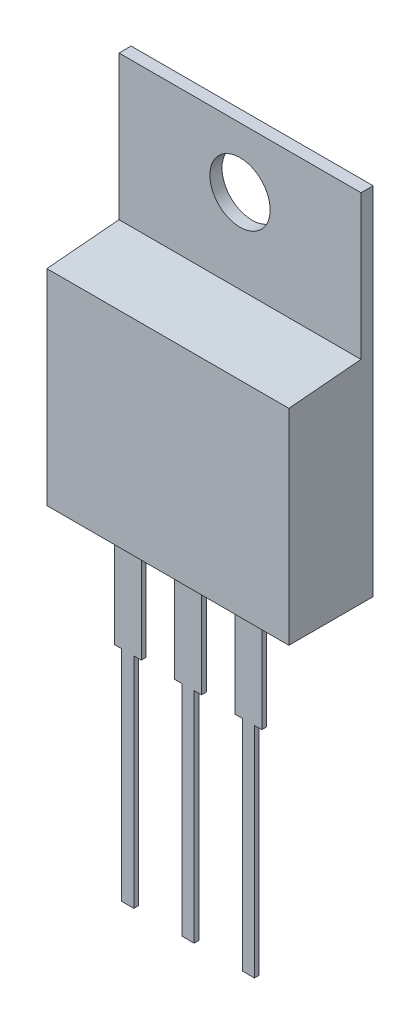
ISO-10303-21;
HEADER;
FILE_DESCRIPTION(('STEP AP214'),'2;1');
FILE_NAME('part.step','',(''),(''),'','','');
FILE_SCHEMA(('AUTOMOTIVE_DESIGN { 1 0 10303 214 1 1 1 1 }'));
ENDSEC;
DATA;
#1=APPLICATION_CONTEXT('core data for automotive mechanical design processes');
#2=APPLICATION_PROTOCOL_DEFINITION('international standard','automotive_design',2000,#1);
#3=PRODUCT_CONTEXT('',#1,'mechanical');
#4=PRODUCT('Part','Part','',(#3));
#5=PRODUCT_RELATED_PRODUCT_CATEGORY('part','',(#4));
#6=PRODUCT_DEFINITION_FORMATION('','',#4);
#7=PRODUCT_DEFINITION_CONTEXT('part definition',#1,'design');
#8=PRODUCT_DEFINITION('design','',#6,#7);
#9=PRODUCT_DEFINITION_SHAPE('','',#8);
#10=(LENGTH_UNIT() NAMED_UNIT(*) SI_UNIT(.MILLI.,.METRE.));
#11=(NAMED_UNIT(*) PLANE_ANGLE_UNIT() SI_UNIT($,.RADIAN.));
#12=(NAMED_UNIT(*) SI_UNIT($,.STERADIAN.) SOLID_ANGLE_UNIT());
#13=UNCERTAINTY_MEASURE_WITH_UNIT(LENGTH_MEASURE(1.E-05),#10,'distance_accuracy_value','');
#14=(GEOMETRIC_REPRESENTATION_CONTEXT(3) GLOBAL_UNCERTAINTY_ASSIGNED_CONTEXT((#13)) GLOBAL_UNIT_ASSIGNED_CONTEXT((#10,
#11,#12)) REPRESENTATION_CONTEXT('',''));
#15=CARTESIAN_POINT('',(0.,0.,0.));
#16=DIRECTION('',(0.,0.,1.));
#17=DIRECTION('',(1.,0.,0.));
#18=AXIS2_PLACEMENT_3D('',#15,#16,#17);
#19=CARTESIAN_POINT('',(7.07,-4.5,2.7));
#20=DIRECTION('',(0.,-1.,0.));
#21=DIRECTION('',(0.,0.,-1.));
#22=AXIS2_PLACEMENT_3D('',#19,#20,#21);
#23=PLANE('',#22);
#24=DIRECTION('',(1.,0.,0.));
#25=VECTOR('',#24,1.);
#26=CARTESIAN_POINT('',(7.07,-4.5,2.5));
#27=LINE('',#26,#25);
#28=CARTESIAN_POINT('',(7.07,-4.5,2.5));
#29=VERTEX_POINT('',#28);
#30=CARTESIAN_POINT('',(7.385,-4.5,2.5));
#31=VERTEX_POINT('',#30);
#32=EDGE_CURVE('E367',#29,#31,#27,.T.);
#33=ORIENTED_EDGE('',*,*,#32,.T.);
#34=DIRECTION('',(0.,0.,1.));
#35=VECTOR('',#34,1.);
#36=CARTESIAN_POINT('',(7.385,-4.5,2.5));
#37=LINE('',#36,#35);
#38=CARTESIAN_POINT('',(7.385,-4.5,2.7));
#39=VERTEX_POINT('',#38);
#40=EDGE_CURVE('E244',#31,#39,#37,.T.);
#41=ORIENTED_EDGE('',*,*,#40,.T.);
#42=DIRECTION('',(1.,0.,0.));
#43=VECTOR('',#42,1.);
#44=CARTESIAN_POINT('',(7.07,-4.5,2.7));
#45=LINE('',#44,#43);
#46=CARTESIAN_POINT('',(7.07,-4.5,2.7));
#47=VERTEX_POINT('',#46);
#48=EDGE_CURVE('E363',#47,#39,#45,.T.);
#49=ORIENTED_EDGE('',*,*,#48,.F.);
#50=DIRECTION('',(0.,0.,-1.));
#51=VECTOR('',#50,1.);
#52=CARTESIAN_POINT('',(7.07,-4.5,2.7));
#53=LINE('',#52,#51);
#54=EDGE_CURVE('E331',#47,#29,#53,.T.);
#55=ORIENTED_EDGE('',*,*,#54,.T.);
#56=EDGE_LOOP('',(#33,#41,#49,#55));
#57=FACE_BOUND('',#56,.T.);
#58=ADVANCED_FACE('F39',(#57),#23,.T.);
#59=CARTESIAN_POINT('',(4.53,-4.5,2.7));
#60=DIRECTION('',(0.,-1.,0.));
#61=DIRECTION('',(0.,0.,-1.));
#62=AXIS2_PLACEMENT_3D('',#59,#60,#61);
#63=PLANE('',#62);
#64=DIRECTION('',(1.,0.,0.));
#65=VECTOR('',#64,1.);
#66=CARTESIAN_POINT('',(4.53,-4.5,2.5));
#67=LINE('',#66,#65);
#68=CARTESIAN_POINT('',(4.53,-4.5,2.5));
#69=VERTEX_POINT('',#68);
#70=CARTESIAN_POINT('',(4.845,-4.5,2.5));
#71=VERTEX_POINT('',#70);
#72=EDGE_CURVE('E911',#69,#71,#67,.T.);
#73=ORIENTED_EDGE('',*,*,#72,.T.);
#74=DIRECTION('',(0.,0.,1.));
#75=VECTOR('',#74,1.);
#76=CARTESIAN_POINT('',(4.845,-4.5,2.5));
#77=LINE('',#76,#75);
#78=CARTESIAN_POINT('',(4.845,-4.5,2.7));
#79=VERTEX_POINT('',#78);
#80=EDGE_CURVE('E301',#71,#79,#77,.T.);
#81=ORIENTED_EDGE('',*,*,#80,.T.);
#82=DIRECTION('',(1.,0.,0.));
#83=VECTOR('',#82,1.);
#84=CARTESIAN_POINT('',(4.53,-4.5,2.7));
#85=LINE('',#84,#83);
#86=CARTESIAN_POINT('',(4.53,-4.5,2.7));
#87=VERTEX_POINT('',#86);
#88=EDGE_CURVE('E419',#87,#79,#85,.T.);
#89=ORIENTED_EDGE('',*,*,#88,.F.);
#90=DIRECTION('',(0.,0.,-1.));
#91=VECTOR('',#90,1.);
#92=CARTESIAN_POINT('',(4.53,-4.5,2.7));
#93=LINE('',#92,#91);
#94=EDGE_CURVE('E928',#87,#69,#93,.T.);
#95=ORIENTED_EDGE('',*,*,#94,.T.);
#96=EDGE_LOOP('',(#73,#81,#89,#95));
#97=FACE_BOUND('',#96,.T.);
#98=ADVANCED_FACE('F568',(#97),#63,.T.);
#99=CARTESIAN_POINT('',(0.,0.,0.51));
#100=DIRECTION('',(0.,1.,0.));
#101=DIRECTION('',(0.,0.,1.));
#102=AXIS2_PLACEMENT_3D('',#99,#100,#101);
#103=PLANE('',#102);
#104=DIRECTION('',(0.,0.,1.));
#105=VECTOR('',#104,1.);
#106=CARTESIAN_POINT('',(4.53,0.,2.5));
#107=LINE('',#106,#105);
#108=CARTESIAN_POINT('',(4.53,0.,2.5));
#109=VERTEX_POINT('',#108);
#110=CARTESIAN_POINT('',(4.53,0.,2.7));
#111=VERTEX_POINT('',#110);
#112=EDGE_CURVE('E398',#109,#111,#107,.T.);
#113=ORIENTED_EDGE('',*,*,#112,.T.);
#114=DIRECTION('',(1.,0.,0.));
#115=VECTOR('',#114,1.);
#116=CARTESIAN_POINT('',(4.53,0.,2.7));
#117=LINE('',#116,#115);
#118=CARTESIAN_POINT('',(5.67,0.,2.7));
#119=VERTEX_POINT('',#118);
#120=EDGE_CURVE('E409',#111,#119,#117,.T.);
#121=ORIENTED_EDGE('',*,*,#120,.T.);
#122=DIRECTION('',(0.,0.,1.));
#123=VECTOR('',#122,1.);
#124=CARTESIAN_POINT('',(5.67,0.,2.5));
#125=LINE('',#124,#123);
#126=CARTESIAN_POINT('',(5.67,0.,2.5));
#127=VERTEX_POINT('',#126);
#128=EDGE_CURVE('E403',#127,#119,#125,.T.);
#129=ORIENTED_EDGE('',*,*,#128,.F.);
#130=DIRECTION('',(1.,0.,0.));
#131=VECTOR('',#130,1.);
#132=CARTESIAN_POINT('',(4.53,0.,2.5));
#133=LINE('',#132,#131);
#134=EDGE_CURVE('E407',#109,#127,#133,.T.);
#135=ORIENTED_EDGE('',*,*,#134,.F.);
#136=EDGE_LOOP('',(#113,#121,#129,#135));
#137=FACE_BOUND('',#136,.T.);
#138=DIRECTION('',(1.,0.,0.));
#139=VECTOR('',#138,1.);
#140=CARTESIAN_POINT('',(0.,0.,0.));
#141=LINE('',#140,#139);
#142=CARTESIAN_POINT('',(0.,0.,0.));
#143=VERTEX_POINT('',#142);
#144=CARTESIAN_POINT('',(10.2,0.,0.));
#145=VERTEX_POINT('',#144);
#146=EDGE_CURVE('E514',#143,#145,#141,.T.);
#147=ORIENTED_EDGE('',*,*,#146,.T.);
#148=DIRECTION('',(0.,0.,-1.));
#149=VECTOR('',#148,1.);
#150=CARTESIAN_POINT('',(10.2,0.,0.51));
#151=LINE('',#150,#149);
#152=CARTESIAN_POINT('',(10.2,0.,3.55));
#153=VERTEX_POINT('',#152);
#154=EDGE_CURVE('E48',#153,#145,#151,.T.);
#155=ORIENTED_EDGE('',*,*,#154,.F.);
#156=DIRECTION('',(1.,0.,0.));
#157=VECTOR('',#156,1.);
#158=CARTESIAN_POINT('',(0.,0.,3.55));
#159=LINE('',#158,#157);
#160=CARTESIAN_POINT('',(0.,0.,3.55));
#161=VERTEX_POINT('',#160);
#162=EDGE_CURVE('E526',#161,#153,#159,.T.);
#163=ORIENTED_EDGE('',*,*,#162,.F.);
#164=DIRECTION('',(0.,0.,-1.));
#165=VECTOR('',#164,1.);
#166=CARTESIAN_POINT('',(0.,0.,0.51));
#167=LINE('',#166,#165);
#168=EDGE_CURVE('E11',#161,#143,#167,.T.);
#169=ORIENTED_EDGE('',*,*,#168,.T.);
#170=EDGE_LOOP('',(#147,#155,#163,#169));
#171=FACE_BOUND('',#170,.T.);
#172=DIRECTION('',(0.,0.,1.));
#173=VECTOR('',#172,1.);
#174=CARTESIAN_POINT('',(1.99,0.,2.5));
#175=LINE('',#174,#173);
#176=CARTESIAN_POINT('',(1.99,0.,2.5));
#177=VERTEX_POINT('',#176);
#178=CARTESIAN_POINT('',(1.99,0.,2.7));
#179=VERTEX_POINT('',#178);
#180=EDGE_CURVE('E454',#177,#179,#175,.T.);
#181=ORIENTED_EDGE('',*,*,#180,.T.);
#182=DIRECTION('',(1.,0.,0.));
#183=VECTOR('',#182,1.);
#184=CARTESIAN_POINT('',(1.99,0.,2.7));
#185=LINE('',#184,#183);
#186=CARTESIAN_POINT('',(3.13,0.,2.7));
#187=VERTEX_POINT('',#186);
#188=EDGE_CURVE('E470',#179,#187,#185,.T.);
#189=ORIENTED_EDGE('',*,*,#188,.T.);
#190=DIRECTION('',(0.,0.,1.));
#191=VECTOR('',#190,1.);
#192=CARTESIAN_POINT('',(3.13,0.,2.5));
#193=LINE('',#192,#191);
#194=CARTESIAN_POINT('',(3.13,0.,2.5));
#195=VERTEX_POINT('',#194);
#196=EDGE_CURVE('E448',#195,#187,#193,.T.);
#197=ORIENTED_EDGE('',*,*,#196,.F.);
#198=DIRECTION('',(1.,0.,0.));
#199=VECTOR('',#198,1.);
#200=CARTESIAN_POINT('',(1.99,0.,2.5));
#201=LINE('',#200,#199);
#202=EDGE_CURVE('E457',#177,#195,#201,.T.);
#203=ORIENTED_EDGE('',*,*,#202,.F.);
#204=EDGE_LOOP('',(#181,#189,#197,#203));
#205=FACE_BOUND('',#204,.T.);
#206=DIRECTION('',(0.,0.,1.));
#207=VECTOR('',#206,1.);
#208=CARTESIAN_POINT('',(7.07,0.,2.5));
#209=LINE('',#208,#207);
#210=CARTESIAN_POINT('',(7.07,0.,2.5));
#211=VERTEX_POINT('',#210);
#212=CARTESIAN_POINT('',(7.07,0.,2.7));
#213=VERTEX_POINT('',#212);
#214=EDGE_CURVE('E338',#211,#213,#209,.T.);
#215=ORIENTED_EDGE('',*,*,#214,.T.);
#216=DIRECTION('',(1.,0.,0.));
#217=VECTOR('',#216,1.);
#218=CARTESIAN_POINT('',(7.07,0.,2.7));
#219=LINE('',#218,#217);
#220=CARTESIAN_POINT('',(8.21,0.,2.7));
#221=VERTEX_POINT('',#220);
#222=EDGE_CURVE('E353',#213,#221,#219,.T.);
#223=ORIENTED_EDGE('',*,*,#222,.T.);
#224=DIRECTION('',(0.,0.,1.));
#225=VECTOR('',#224,1.);
#226=CARTESIAN_POINT('',(8.21,0.,2.5));
#227=LINE('',#226,#225);
#228=CARTESIAN_POINT('',(8.21,0.,2.5));
#229=VERTEX_POINT('',#228);
#230=EDGE_CURVE('E332',#229,#221,#227,.T.);
#231=ORIENTED_EDGE('',*,*,#230,.F.);
#232=DIRECTION('',(1.,0.,0.));
#233=VECTOR('',#232,1.);
#234=CARTESIAN_POINT('',(7.07,0.,2.5));
#235=LINE('',#234,#233);
#236=EDGE_CURVE('E341',#211,#229,#235,.T.);
#237=ORIENTED_EDGE('',*,*,#236,.F.);
#238=EDGE_LOOP('',(#215,#223,#231,#237));
#239=FACE_BOUND('',#238,.T.);
#240=ADVANCED_FACE('F380',(#137,#171,#205,#239),#103,.F.);
#241=CARTESIAN_POINT('',(1.99,-4.5,2.7));
#242=DIRECTION('',(0.,-1.,0.));
#243=DIRECTION('',(0.,0.,-1.));
#244=AXIS2_PLACEMENT_3D('',#241,#242,#243);
#245=PLANE('',#244);
#246=DIRECTION('',(1.,0.,0.));
#247=VECTOR('',#246,1.);
#248=CARTESIAN_POINT('',(1.99,-4.5,2.5));
#249=LINE('',#248,#247);
#250=CARTESIAN_POINT('',(1.99,-4.5,2.5));
#251=VERTEX_POINT('',#250);
#252=CARTESIAN_POINT('',(2.305,-4.5,2.5));
#253=VERTEX_POINT('',#252);
#254=EDGE_CURVE('E497',#251,#253,#249,.T.);
#255=ORIENTED_EDGE('',*,*,#254,.T.);
#256=DIRECTION('',(0.,0.,1.));
#257=VECTOR('',#256,1.);
#258=CARTESIAN_POINT('',(2.305,-4.5,2.5));
#259=LINE('',#258,#257);
#260=CARTESIAN_POINT('',(2.305,-4.5,2.7));
#261=VERTEX_POINT('',#260);
#262=EDGE_CURVE('E442',#253,#261,#259,.T.);
#263=ORIENTED_EDGE('',*,*,#262,.T.);
#264=DIRECTION('',(1.,0.,0.));
#265=VECTOR('',#264,1.);
#266=CARTESIAN_POINT('',(1.99,-4.5,2.7));
#267=LINE('',#266,#265);
#268=CARTESIAN_POINT('',(1.99,-4.5,2.7));
#269=VERTEX_POINT('',#268);
#270=EDGE_CURVE('E482',#269,#261,#267,.T.);
#271=ORIENTED_EDGE('',*,*,#270,.F.);
#272=DIRECTION('',(0.,0.,-1.));
#273=VECTOR('',#272,1.);
#274=CARTESIAN_POINT('',(1.99,-4.5,2.7));
#275=LINE('',#274,#273);
#276=EDGE_CURVE('E447',#269,#251,#275,.T.);
#277=ORIENTED_EDGE('',*,*,#276,.T.);
#278=EDGE_LOOP('',(#255,#263,#271,#277));
#279=FACE_BOUND('',#278,.T.);
#280=ADVANCED_FACE('F631',(#279),#245,.T.);
#281=CARTESIAN_POINT('',(0.,0.,0.51));
#282=DIRECTION('',(0.,0.,-1.));
#283=DIRECTION('',(-1.,0.,0.));
#284=AXIS2_PLACEMENT_3D('',#281,#282,#283);
#285=PLANE('',#284);
#286=CARTESIAN_POINT('',(5.1,12.46,0.51));
#287=DIRECTION('',(0.,0.,1.));
#288=DIRECTION('',(1.,0.,0.));
#289=AXIS2_PLACEMENT_3D('',#286,#287,#288);
#290=CIRCLE('',#289,1.27);
#291=CARTESIAN_POINT('',(6.37,12.46,0.51));
#292=VERTEX_POINT('',#291);
#293=EDGE_CURVE('E284',#292,#292,#290,.T.);
#294=ORIENTED_EDGE('',*,*,#293,.F.);
#295=EDGE_LOOP('',(#294));
#296=FACE_BOUND('',#295,.T.);
#297=DIRECTION('',(1.,0.,0.));
#298=VECTOR('',#297,1.);
#299=CARTESIAN_POINT('',(0.,8.91596553711881,0.51));
#300=LINE('',#299,#298);
#301=CARTESIAN_POINT('',(10.2,8.91596553711881,0.51));
#302=VERTEX_POINT('',#301);
#303=CARTESIAN_POINT('',(0.,8.91596553711881,0.51));
#304=VERTEX_POINT('',#303);
#305=EDGE_CURVE('E494',#302,#304,#300,.F.);
#306=ORIENTED_EDGE('',*,*,#305,.F.);
#307=DIRECTION('',(0.,1.,0.));
#308=VECTOR('',#307,1.);
#309=CARTESIAN_POINT('',(10.2,0.,0.51));
#310=LINE('',#309,#308);
#311=CARTESIAN_POINT('',(10.2,15.,0.51));
#312=VERTEX_POINT('',#311);
#313=EDGE_CURVE('E520',#302,#312,#310,.T.);
#314=ORIENTED_EDGE('',*,*,#313,.T.);
#315=DIRECTION('',(-1.,0.,0.));
#316=VECTOR('',#315,1.);
#317=CARTESIAN_POINT('',(0.,15.,0.51));
#318=LINE('',#317,#316);
#319=CARTESIAN_POINT('',(0.,15.,0.51));
#320=VERTEX_POINT('',#319);
#321=EDGE_CURVE('E507',#312,#320,#318,.T.);
#322=ORIENTED_EDGE('',*,*,#321,.T.);
#323=DIRECTION('',(0.,-1.,0.));
#324=VECTOR('',#323,1.);
#325=CARTESIAN_POINT('',(0.,0.,0.51));
#326=LINE('',#325,#324);
#327=EDGE_CURVE('E511',#320,#304,#326,.T.);
#328=ORIENTED_EDGE('',*,*,#327,.T.);
#329=EDGE_LOOP('',(#306,#314,#322,#328));
#330=FACE_BOUND('',#329,.T.);
#331=ADVANCED_FACE('F555',(#296,#330),#285,.F.);
#332=CARTESIAN_POINT('',(0.,0.,0.51));
#333=DIRECTION('',(1.,0.,0.));
#334=DIRECTION('',(0.,0.,-1.));
#335=AXIS2_PLACEMENT_3D('',#332,#333,#334);
#336=PLANE('',#335);
#337=DIRECTION('',(0.,-1.,0.));
#338=VECTOR('',#337,1.);
#339=CARTESIAN_POINT('',(0.,0.,0.));
#340=LINE('',#339,#338);
#341=CARTESIAN_POINT('',(0.,15.,0.));
#342=VERTEX_POINT('',#341);
#343=EDGE_CURVE('E493',#342,#143,#340,.T.);
#344=ORIENTED_EDGE('',*,*,#343,.T.);
#345=ORIENTED_EDGE('',*,*,#168,.F.);
#346=DIRECTION('',(0.,-1.,0.));
#347=VECTOR('',#346,1.);
#348=CARTESIAN_POINT('',(0.,0.,3.55));
#349=LINE('',#348,#347);
#350=CARTESIAN_POINT('',(0.,8.65,3.55));
#351=VERTEX_POINT('',#350);
#352=EDGE_CURVE('E496',#351,#161,#349,.T.);
#353=ORIENTED_EDGE('',*,*,#352,.F.);
#354=DIRECTION('',(0.,-0.0871557427476582,0.996194698091746));
#355=VECTOR('',#354,1.);
#356=CARTESIAN_POINT('',(0.,8.84823876183154,1.28412058383092));
#357=LINE('',#356,#355);
#358=EDGE_CURVE('E486',#351,#304,#357,.F.);
#359=ORIENTED_EDGE('',*,*,#358,.T.);
#360=ORIENTED_EDGE('',*,*,#327,.F.);
#361=DIRECTION('',(0.,0.,-1.));
#362=VECTOR('',#361,1.);
#363=CARTESIAN_POINT('',(0.,15.,0.51));
#364=LINE('',#363,#362);
#365=EDGE_CURVE('E504',#320,#342,#364,.T.);
#366=ORIENTED_EDGE('',*,*,#365,.T.);
#367=EDGE_LOOP('',(#344,#345,#353,#359,#360,#366));
#368=FACE_BOUND('',#367,.T.);
#369=ADVANCED_FACE('F537',(#368),#336,.F.);
#370=CARTESIAN_POINT('',(10.2,0.,0.51));
#371=DIRECTION('',(-1.,0.,0.));
#372=DIRECTION('',(0.,0.,1.));
#373=AXIS2_PLACEMENT_3D('',#370,#371,#372);
#374=PLANE('',#373);
#375=DIRECTION('',(0.,1.,0.));
#376=VECTOR('',#375,1.);
#377=CARTESIAN_POINT('',(10.2,0.,0.));
#378=LINE('',#377,#376);
#379=CARTESIAN_POINT('',(10.2,15.,0.));
#380=VERTEX_POINT('',#379);
#381=EDGE_CURVE('E512',#145,#380,#378,.T.);
#382=ORIENTED_EDGE('',*,*,#381,.T.);
#383=DIRECTION('',(0.,0.,-1.));
#384=VECTOR('',#383,1.);
#385=CARTESIAN_POINT('',(10.2,15.,0.51));
#386=LINE('',#385,#384);
#387=EDGE_CURVE('E501',#312,#380,#386,.T.);
#388=ORIENTED_EDGE('',*,*,#387,.F.);
#389=ORIENTED_EDGE('',*,*,#313,.F.);
#390=DIRECTION('',(0.,-0.0871557427476582,0.996194698091746));
#391=VECTOR('',#390,1.);
#392=CARTESIAN_POINT('',(10.2,8.65,3.55));
#393=LINE('',#392,#391);
#394=CARTESIAN_POINT('',(10.2,8.65,3.55));
#395=VERTEX_POINT('',#394);
#396=EDGE_CURVE('E489',#395,#302,#393,.F.);
#397=ORIENTED_EDGE('',*,*,#396,.F.);
#398=DIRECTION('',(0.,1.,0.));
#399=VECTOR('',#398,1.);
#400=CARTESIAN_POINT('',(10.2,0.,3.55));
#401=LINE('',#400,#399);
#402=EDGE_CURVE('E524',#153,#395,#401,.T.);
#403=ORIENTED_EDGE('',*,*,#402,.F.);
#404=ORIENTED_EDGE('',*,*,#154,.T.);
#405=EDGE_LOOP('',(#382,#388,#389,#397,#403,#404));
#406=FACE_BOUND('',#405,.T.);
#407=ADVANCED_FACE('F544',(#406),#374,.F.);
#408=CARTESIAN_POINT('',(0.,15.,0.51));
#409=DIRECTION('',(0.,-1.,0.));
#410=DIRECTION('',(0.,0.,-1.));
#411=AXIS2_PLACEMENT_3D('',#408,#409,#410);
#412=PLANE('',#411);
#413=DIRECTION('',(-1.,0.,0.));
#414=VECTOR('',#413,1.);
#415=CARTESIAN_POINT('',(0.,15.,0.));
#416=LINE('',#415,#414);
#417=EDGE_CURVE('E508',#380,#342,#416,.T.);
#418=ORIENTED_EDGE('',*,*,#417,.T.);
#419=ORIENTED_EDGE('',*,*,#365,.F.);
#420=ORIENTED_EDGE('',*,*,#321,.F.);
#421=ORIENTED_EDGE('',*,*,#387,.T.);
#422=EDGE_LOOP('',(#418,#419,#420,#421));
#423=FACE_BOUND('',#422,.T.);
#424=ADVANCED_FACE('F552',(#423),#412,.F.);
#425=CARTESIAN_POINT('',(0.,0.,0.));
#426=DIRECTION('',(0.,0.,-1.));
#427=DIRECTION('',(-1.,0.,0.));
#428=AXIS2_PLACEMENT_3D('',#425,#426,#427);
#429=PLANE('',#428);
#430=CARTESIAN_POINT('',(5.1,12.46,0.));
#431=DIRECTION('',(0.,0.,-1.));
#432=DIRECTION('',(-1.,0.,0.));
#433=AXIS2_PLACEMENT_3D('',#430,#431,#432);
#434=CIRCLE('',#433,1.27);
#435=CARTESIAN_POINT('',(3.83,12.46,0.));
#436=VERTEX_POINT('',#435);
#437=EDGE_CURVE('E267',#436,#436,#434,.F.);
#438=ORIENTED_EDGE('',*,*,#437,.T.);
#439=EDGE_LOOP('',(#438));
#440=FACE_BOUND('',#439,.T.);
#441=ORIENTED_EDGE('',*,*,#343,.F.);
#442=ORIENTED_EDGE('',*,*,#417,.F.);
#443=ORIENTED_EDGE('',*,*,#381,.F.);
#444=ORIENTED_EDGE('',*,*,#146,.F.);
#445=EDGE_LOOP('',(#441,#442,#443,#444));
#446=FACE_BOUND('',#445,.T.);
#447=ADVANCED_FACE('F549',(#440,#446),#429,.T.);
#448=CARTESIAN_POINT('',(0.,8.65,3.55));
#449=DIRECTION('',(0.,0.996194698091746,0.0871557427476582));
#450=DIRECTION('',(0.,-0.0871557427476582,0.996194698091746));
#451=AXIS2_PLACEMENT_3D('',#448,#449,#450);
#452=PLANE('',#451);
#453=ORIENTED_EDGE('',*,*,#305,.T.);
#454=ORIENTED_EDGE('',*,*,#358,.F.);
#455=DIRECTION('',(-1.,0.,0.));
#456=VECTOR('',#455,1.);
#457=CARTESIAN_POINT('',(0.,8.65,3.55));
#458=LINE('',#457,#456);
#459=EDGE_CURVE('E490',#395,#351,#458,.T.);
#460=ORIENTED_EDGE('',*,*,#459,.F.);
#461=ORIENTED_EDGE('',*,*,#396,.T.);
#462=EDGE_LOOP('',(#453,#454,#460,#461));
#463=FACE_BOUND('',#462,.T.);
#464=ADVANCED_FACE('F41',(#463),#452,.T.);
#465=CARTESIAN_POINT('',(0.,0.,3.55));
#466=DIRECTION('',(0.,0.,-1.));
#467=DIRECTION('',(-1.,0.,0.));
#468=AXIS2_PLACEMENT_3D('',#465,#466,#467);
#469=PLANE('',#468);
#470=ORIENTED_EDGE('',*,*,#352,.T.);
#471=ORIENTED_EDGE('',*,*,#162,.T.);
#472=ORIENTED_EDGE('',*,*,#402,.T.);
#473=ORIENTED_EDGE('',*,*,#459,.T.);
#474=EDGE_LOOP('',(#470,#471,#472,#473));
#475=FACE_BOUND('',#474,.T.);
#476=ADVANCED_FACE('F531',(#475),#469,.F.);
#477=CARTESIAN_POINT('',(1.99,0.,2.5));
#478=DIRECTION('',(0.,0.,1.));
#479=DIRECTION('',(1.,0.,0.));
#480=AXIS2_PLACEMENT_3D('',#477,#478,#479);
#481=PLANE('',#480);
#482=DIRECTION('',(0.,-1.,0.));
#483=VECTOR('',#482,1.);
#484=CARTESIAN_POINT('',(3.13,0.,2.5));
#485=LINE('',#484,#483);
#486=CARTESIAN_POINT('',(3.13,-4.5,2.5));
#487=VERTEX_POINT('',#486);
#488=EDGE_CURVE('E444',#195,#487,#485,.T.);
#489=ORIENTED_EDGE('',*,*,#488,.T.);
#490=CARTESIAN_POINT('',(2.815,-4.5,2.5));
#491=VERTEX_POINT('',#490);
#492=EDGE_CURVE('E485',#491,#487,#249,.T.);
#493=ORIENTED_EDGE('',*,*,#492,.F.);
#494=DIRECTION('',(0.,-1.,0.));
#495=VECTOR('',#494,1.);
#496=CARTESIAN_POINT('',(2.815,-4.5,2.5));
#497=LINE('',#496,#495);
#498=CARTESIAN_POINT('',(2.815,-13.72,2.5));
#499=VERTEX_POINT('',#498);
#500=EDGE_CURVE('E909',#491,#499,#497,.T.);
#501=ORIENTED_EDGE('',*,*,#500,.T.);
#502=DIRECTION('',(1.,0.,0.));
#503=VECTOR('',#502,1.);
#504=CARTESIAN_POINT('',(2.305,-13.72,2.5));
#505=LINE('',#504,#503);
#506=CARTESIAN_POINT('',(2.305,-13.72,2.5));
#507=VERTEX_POINT('',#506);
#508=EDGE_CURVE('E441',#507,#499,#505,.T.);
#509=ORIENTED_EDGE('',*,*,#508,.F.);
#510=DIRECTION('',(0.,-1.,0.));
#511=VECTOR('',#510,1.);
#512=CARTESIAN_POINT('',(2.305,-4.5,2.5));
#513=LINE('',#512,#511);
#514=EDGE_CURVE('E432',#253,#507,#513,.T.);
#515=ORIENTED_EDGE('',*,*,#514,.F.);
#516=ORIENTED_EDGE('',*,*,#254,.F.);
#517=DIRECTION('',(0.,-1.,0.));
#518=VECTOR('',#517,1.);
#519=CARTESIAN_POINT('',(1.99,0.,2.5));
#520=LINE('',#519,#518);
#521=EDGE_CURVE('E445',#177,#251,#520,.T.);
#522=ORIENTED_EDGE('',*,*,#521,.F.);
#523=ORIENTED_EDGE('',*,*,#202,.T.);
#524=EDGE_LOOP('',(#489,#493,#501,#509,#515,#516,#522,#523));
#525=FACE_BOUND('',#524,.T.);
#526=ADVANCED_FACE('F563',(#525),#481,.F.);
#527=DIRECTION('',(0.,0.,1.));
#528=VECTOR('',#527,1.);
#529=CARTESIAN_POINT('',(2.815,-4.5,2.5));
#530=LINE('',#529,#528);
#531=CARTESIAN_POINT('',(2.815,-4.5,2.7));
#532=VERTEX_POINT('',#531);
#533=EDGE_CURVE('E427',#491,#532,#530,.T.);
#534=ORIENTED_EDGE('',*,*,#533,.F.);
#535=ORIENTED_EDGE('',*,*,#492,.T.);
#536=DIRECTION('',(0.,0.,-1.));
#537=VECTOR('',#536,1.);
#538=CARTESIAN_POINT('',(3.13,-4.5,2.7));
#539=LINE('',#538,#537);
#540=CARTESIAN_POINT('',(3.13,-4.5,2.7));
#541=VERTEX_POINT('',#540);
#542=EDGE_CURVE('E460',#541,#487,#539,.T.);
#543=ORIENTED_EDGE('',*,*,#542,.F.);
#544=EDGE_CURVE('E473',#532,#541,#267,.T.);
#545=ORIENTED_EDGE('',*,*,#544,.F.);
#546=EDGE_LOOP('',(#534,#535,#543,#545));
#547=FACE_BOUND('',#546,.T.);
#548=ADVANCED_FACE('F626',(#547),#245,.T.);
#549=CARTESIAN_POINT('',(1.99,0.,2.7));
#550=DIRECTION('',(0.,0.,1.));
#551=DIRECTION('',(1.,0.,0.));
#552=AXIS2_PLACEMENT_3D('',#549,#550,#551);
#553=PLANE('',#552);
#554=DIRECTION('',(0.,1.,0.));
#555=VECTOR('',#554,1.);
#556=CARTESIAN_POINT('',(3.13,0.,2.7));
#557=LINE('',#556,#555);
#558=EDGE_CURVE('E463',#187,#541,#557,.F.);
#559=ORIENTED_EDGE('',*,*,#558,.F.);
#560=ORIENTED_EDGE('',*,*,#188,.F.);
#561=DIRECTION('',(0.,1.,0.));
#562=VECTOR('',#561,1.);
#563=CARTESIAN_POINT('',(1.99,0.,2.7));
#564=LINE('',#563,#562);
#565=EDGE_CURVE('E451',#179,#269,#564,.F.);
#566=ORIENTED_EDGE('',*,*,#565,.T.);
#567=ORIENTED_EDGE('',*,*,#270,.T.);
#568=DIRECTION('',(0.,-1.,0.));
#569=VECTOR('',#568,1.);
#570=CARTESIAN_POINT('',(2.305,-4.5,2.7));
#571=LINE('',#570,#569);
#572=CARTESIAN_POINT('',(2.305,-13.72,2.7));
#573=VERTEX_POINT('',#572);
#574=EDGE_CURVE('E897',#261,#573,#571,.T.);
#575=ORIENTED_EDGE('',*,*,#574,.T.);
#576=DIRECTION('',(1.,0.,0.));
#577=VECTOR('',#576,1.);
#578=CARTESIAN_POINT('',(2.305,-13.72,2.7));
#579=LINE('',#578,#577);
#580=CARTESIAN_POINT('',(2.815,-13.72,2.7));
#581=VERTEX_POINT('',#580);
#582=EDGE_CURVE('E439',#573,#581,#579,.T.);
#583=ORIENTED_EDGE('',*,*,#582,.T.);
#584=DIRECTION('',(0.,-1.,0.));
#585=VECTOR('',#584,1.);
#586=CARTESIAN_POINT('',(2.815,-4.5,2.7));
#587=LINE('',#586,#585);
#588=EDGE_CURVE('E424',#532,#581,#587,.T.);
#589=ORIENTED_EDGE('',*,*,#588,.F.);
#590=ORIENTED_EDGE('',*,*,#544,.T.);
#591=EDGE_LOOP('',(#559,#560,#566,#567,#575,#583,#589,#590));
#592=FACE_BOUND('',#591,.T.);
#593=ADVANCED_FACE('F619',(#592),#553,.T.);
#594=CARTESIAN_POINT('',(1.99,0.,0.));
#595=DIRECTION('',(1.,0.,0.));
#596=DIRECTION('',(0.,0.,-1.));
#597=AXIS2_PLACEMENT_3D('',#594,#595,#596);
#598=PLANE('',#597);
#599=ORIENTED_EDGE('',*,*,#521,.T.);
#600=ORIENTED_EDGE('',*,*,#276,.F.);
#601=ORIENTED_EDGE('',*,*,#565,.F.);
#602=ORIENTED_EDGE('',*,*,#180,.F.);
#603=EDGE_LOOP('',(#599,#600,#601,#602));
#604=FACE_BOUND('',#603,.T.);
#605=ADVANCED_FACE('F616',(#604),#598,.F.);
#606=CARTESIAN_POINT('',(3.13,0.,0.));
#607=DIRECTION('',(1.,0.,0.));
#608=DIRECTION('',(0.,0.,-1.));
#609=AXIS2_PLACEMENT_3D('',#606,#607,#608);
#610=PLANE('',#609);
#611=ORIENTED_EDGE('',*,*,#488,.F.);
#612=ORIENTED_EDGE('',*,*,#196,.T.);
#613=ORIENTED_EDGE('',*,*,#558,.T.);
#614=ORIENTED_EDGE('',*,*,#542,.T.);
#615=EDGE_LOOP('',(#611,#612,#613,#614));
#616=FACE_BOUND('',#615,.T.);
#617=ADVANCED_FACE('F614',(#616),#610,.T.);
#618=CARTESIAN_POINT('',(2.305,-13.72,2.7));
#619=DIRECTION('',(0.,-1.,0.));
#620=DIRECTION('',(0.,0.,-1.));
#621=AXIS2_PLACEMENT_3D('',#618,#619,#620);
#622=PLANE('',#621);
#623=DIRECTION('',(0.,0.,-1.));
#624=VECTOR('',#623,1.);
#625=CARTESIAN_POINT('',(2.815,-13.72,2.7));
#626=LINE('',#625,#624);
#627=EDGE_CURVE('E428',#581,#499,#626,.T.);
#628=ORIENTED_EDGE('',*,*,#627,.F.);
#629=ORIENTED_EDGE('',*,*,#582,.F.);
#630=DIRECTION('',(0.,0.,-1.));
#631=VECTOR('',#630,1.);
#632=CARTESIAN_POINT('',(2.305,-13.72,2.7));
#633=LINE('',#632,#631);
#634=EDGE_CURVE('E900',#573,#507,#633,.T.);
#635=ORIENTED_EDGE('',*,*,#634,.T.);
#636=ORIENTED_EDGE('',*,*,#508,.T.);
#637=EDGE_LOOP('',(#628,#629,#635,#636));
#638=FACE_BOUND('',#637,.T.);
#639=ADVANCED_FACE('F607',(#638),#622,.T.);
#640=CARTESIAN_POINT('',(2.305,0.,0.));
#641=DIRECTION('',(1.,0.,0.));
#642=DIRECTION('',(0.,0.,-1.));
#643=AXIS2_PLACEMENT_3D('',#640,#641,#642);
#644=PLANE('',#643);
#645=ORIENTED_EDGE('',*,*,#514,.T.);
#646=ORIENTED_EDGE('',*,*,#634,.F.);
#647=ORIENTED_EDGE('',*,*,#574,.F.);
#648=ORIENTED_EDGE('',*,*,#262,.F.);
#649=EDGE_LOOP('',(#645,#646,#647,#648));
#650=FACE_BOUND('',#649,.T.);
#651=ADVANCED_FACE('F604',(#650),#644,.F.);
#652=CARTESIAN_POINT('',(2.815,0.,0.));
#653=DIRECTION('',(1.,0.,0.));
#654=DIRECTION('',(0.,0.,-1.));
#655=AXIS2_PLACEMENT_3D('',#652,#653,#654);
#656=PLANE('',#655);
#657=ORIENTED_EDGE('',*,*,#500,.F.);
#658=ORIENTED_EDGE('',*,*,#533,.T.);
#659=ORIENTED_EDGE('',*,*,#588,.T.);
#660=ORIENTED_EDGE('',*,*,#627,.T.);
#661=EDGE_LOOP('',(#657,#658,#659,#660));
#662=FACE_BOUND('',#661,.T.);
#663=ADVANCED_FACE('F603',(#662),#656,.T.);
#664=CARTESIAN_POINT('',(4.53,0.,2.5));
#665=DIRECTION('',(0.,0.,1.));
#666=DIRECTION('',(1.,0.,0.));
#667=AXIS2_PLACEMENT_3D('',#664,#665,#666);
#668=PLANE('',#667);
#669=DIRECTION('',(0.,-1.,0.));
#670=VECTOR('',#669,1.);
#671=CARTESIAN_POINT('',(5.67,0.,2.5));
#672=LINE('',#671,#670);
#673=CARTESIAN_POINT('',(5.67,-4.5,2.5));
#674=VERTEX_POINT('',#673);
#675=EDGE_CURVE('E387',#127,#674,#672,.T.);
#676=ORIENTED_EDGE('',*,*,#675,.T.);
#677=CARTESIAN_POINT('',(5.355,-4.5,2.5));
#678=VERTEX_POINT('',#677);
#679=EDGE_CURVE('E305',#678,#674,#67,.T.);
#680=ORIENTED_EDGE('',*,*,#679,.F.);
#681=DIRECTION('',(0.,-1.,0.));
#682=VECTOR('',#681,1.);
#683=CARTESIAN_POINT('',(5.355,-4.5,2.5));
#684=LINE('',#683,#682);
#685=CARTESIAN_POINT('',(5.355,-13.72,2.5));
#686=VERTEX_POINT('',#685);
#687=EDGE_CURVE('E259',#678,#686,#684,.T.);
#688=ORIENTED_EDGE('',*,*,#687,.T.);
#689=DIRECTION('',(1.,0.,0.));
#690=VECTOR('',#689,1.);
#691=CARTESIAN_POINT('',(4.845,-13.72,2.5));
#692=LINE('',#691,#690);
#693=CARTESIAN_POINT('',(4.845,-13.72,2.5));
#694=VERTEX_POINT('',#693);
#695=EDGE_CURVE('E326',#694,#686,#692,.T.);
#696=ORIENTED_EDGE('',*,*,#695,.F.);
#697=DIRECTION('',(0.,-1.,0.));
#698=VECTOR('',#697,1.);
#699=CARTESIAN_POINT('',(4.845,-4.5,2.5));
#700=LINE('',#699,#698);
#701=EDGE_CURVE('E295',#71,#694,#700,.T.);
#702=ORIENTED_EDGE('',*,*,#701,.F.);
#703=ORIENTED_EDGE('',*,*,#72,.F.);
#704=DIRECTION('',(0.,-1.,0.));
#705=VECTOR('',#704,1.);
#706=CARTESIAN_POINT('',(4.53,0.,2.5));
#707=LINE('',#706,#705);
#708=EDGE_CURVE('E406',#109,#69,#707,.T.);
#709=ORIENTED_EDGE('',*,*,#708,.F.);
#710=ORIENTED_EDGE('',*,*,#134,.T.);
#711=EDGE_LOOP('',(#676,#680,#688,#696,#702,#703,#709,#710));
#712=FACE_BOUND('',#711,.T.);
#713=ADVANCED_FACE('F599',(#712),#668,.F.);
#714=DIRECTION('',(0.,0.,1.));
#715=VECTOR('',#714,1.);
#716=CARTESIAN_POINT('',(5.355,-4.5,2.5));
#717=LINE('',#716,#715);
#718=CARTESIAN_POINT('',(5.355,-4.5,2.7));
#719=VERTEX_POINT('',#718);
#720=EDGE_CURVE('E312',#678,#719,#717,.T.);
#721=ORIENTED_EDGE('',*,*,#720,.F.);
#722=ORIENTED_EDGE('',*,*,#679,.T.);
#723=DIRECTION('',(0.,0.,-1.));
#724=VECTOR('',#723,1.);
#725=CARTESIAN_POINT('',(5.67,-4.5,2.7));
#726=LINE('',#725,#724);
#727=CARTESIAN_POINT('',(5.67,-4.5,2.7));
#728=VERTEX_POINT('',#727);
#729=EDGE_CURVE('E389',#728,#674,#726,.T.);
#730=ORIENTED_EDGE('',*,*,#729,.F.);
#731=EDGE_CURVE('E412',#719,#728,#85,.T.);
#732=ORIENTED_EDGE('',*,*,#731,.F.);
#733=EDGE_LOOP('',(#721,#722,#730,#732));
#734=FACE_BOUND('',#733,.T.);
#735=ADVANCED_FACE('F575',(#734),#63,.T.);
#736=CARTESIAN_POINT('',(4.53,0.,2.7));
#737=DIRECTION('',(0.,0.,1.));
#738=DIRECTION('',(1.,0.,0.));
#739=AXIS2_PLACEMENT_3D('',#736,#737,#738);
#740=PLANE('',#739);
#741=DIRECTION('',(0.,1.,0.));
#742=VECTOR('',#741,1.);
#743=CARTESIAN_POINT('',(5.67,0.,2.7));
#744=LINE('',#743,#742);
#745=EDGE_CURVE('E395',#119,#728,#744,.F.);
#746=ORIENTED_EDGE('',*,*,#745,.F.);
#747=ORIENTED_EDGE('',*,*,#120,.F.);
#748=DIRECTION('',(0.,1.,0.));
#749=VECTOR('',#748,1.);
#750=CARTESIAN_POINT('',(4.53,0.,2.7));
#751=LINE('',#750,#749);
#752=EDGE_CURVE('E926',#111,#87,#751,.F.);
#753=ORIENTED_EDGE('',*,*,#752,.T.);
#754=ORIENTED_EDGE('',*,*,#88,.T.);
#755=DIRECTION('',(0.,-1.,0.));
#756=VECTOR('',#755,1.);
#757=CARTESIAN_POINT('',(4.845,-4.5,2.7));
#758=LINE('',#757,#756);
#759=CARTESIAN_POINT('',(4.845,-13.72,2.7));
#760=VERTEX_POINT('',#759);
#761=EDGE_CURVE('E64',#79,#760,#758,.T.);
#762=ORIENTED_EDGE('',*,*,#761,.T.);
#763=DIRECTION('',(1.,0.,0.));
#764=VECTOR('',#763,1.);
#765=CARTESIAN_POINT('',(4.845,-13.72,2.7));
#766=LINE('',#765,#764);
#767=CARTESIAN_POINT('',(5.355,-13.72,2.7));
#768=VERTEX_POINT('',#767);
#769=EDGE_CURVE('E304',#760,#768,#766,.T.);
#770=ORIENTED_EDGE('',*,*,#769,.T.);
#771=DIRECTION('',(0.,-1.,0.));
#772=VECTOR('',#771,1.);
#773=CARTESIAN_POINT('',(5.355,-4.5,2.7));
#774=LINE('',#773,#772);
#775=EDGE_CURVE('E321',#719,#768,#774,.T.);
#776=ORIENTED_EDGE('',*,*,#775,.F.);
#777=ORIENTED_EDGE('',*,*,#731,.T.);
#778=EDGE_LOOP('',(#746,#747,#753,#754,#762,#770,#776,#777));
#779=FACE_BOUND('',#778,.T.);
#780=ADVANCED_FACE('F592',(#779),#740,.T.);
#781=CARTESIAN_POINT('',(4.53,0.,0.));
#782=DIRECTION('',(1.,0.,0.));
#783=DIRECTION('',(0.,0.,-1.));
#784=AXIS2_PLACEMENT_3D('',#781,#782,#783);
#785=PLANE('',#784);
#786=ORIENTED_EDGE('',*,*,#708,.T.);
#787=ORIENTED_EDGE('',*,*,#94,.F.);
#788=ORIENTED_EDGE('',*,*,#752,.F.);
#789=ORIENTED_EDGE('',*,*,#112,.F.);
#790=EDGE_LOOP('',(#786,#787,#788,#789));
#791=FACE_BOUND('',#790,.T.);
#792=ADVANCED_FACE('F587',(#791),#785,.F.);
#793=CARTESIAN_POINT('',(5.67,0.,0.));
#794=DIRECTION('',(1.,0.,0.));
#795=DIRECTION('',(0.,0.,-1.));
#796=AXIS2_PLACEMENT_3D('',#793,#794,#795);
#797=PLANE('',#796);
#798=ORIENTED_EDGE('',*,*,#675,.F.);
#799=ORIENTED_EDGE('',*,*,#128,.T.);
#800=ORIENTED_EDGE('',*,*,#745,.T.);
#801=ORIENTED_EDGE('',*,*,#729,.T.);
#802=EDGE_LOOP('',(#798,#799,#800,#801));
#803=FACE_BOUND('',#802,.T.);
#804=ADVANCED_FACE('F583',(#803),#797,.T.);
#805=CARTESIAN_POINT('',(7.07,0.,2.5));
#806=DIRECTION('',(0.,0.,1.));
#807=DIRECTION('',(1.,0.,0.));
#808=AXIS2_PLACEMENT_3D('',#805,#806,#807);
#809=PLANE('',#808);
#810=DIRECTION('',(0.,-1.,0.));
#811=VECTOR('',#810,1.);
#812=CARTESIAN_POINT('',(8.21,0.,2.5));
#813=LINE('',#812,#811);
#814=CARTESIAN_POINT('',(8.21,-4.5,2.5));
#815=VERTEX_POINT('',#814);
#816=EDGE_CURVE('E328',#229,#815,#813,.T.);
#817=ORIENTED_EDGE('',*,*,#816,.T.);
#818=CARTESIAN_POINT('',(7.895,-4.5,2.5));
#819=VERTEX_POINT('',#818);
#820=EDGE_CURVE('E275',#819,#815,#27,.T.);
#821=ORIENTED_EDGE('',*,*,#820,.F.);
#822=DIRECTION('',(0.,-1.,0.));
#823=VECTOR('',#822,1.);
#824=CARTESIAN_POINT('',(7.895,-4.5,2.5));
#825=LINE('',#824,#823);
#826=CARTESIAN_POINT('',(7.895,-13.72,2.5));
#827=VERTEX_POINT('',#826);
#828=EDGE_CURVE('E255',#819,#827,#825,.T.);
#829=ORIENTED_EDGE('',*,*,#828,.T.);
#830=DIRECTION('',(1.,0.,0.));
#831=VECTOR('',#830,1.);
#832=CARTESIAN_POINT('',(7.385,-13.72,2.5));
#833=LINE('',#832,#831);
#834=CARTESIAN_POINT('',(7.385,-13.72,2.5));
#835=VERTEX_POINT('',#834);
#836=EDGE_CURVE('E251',#835,#827,#833,.T.);
#837=ORIENTED_EDGE('',*,*,#836,.F.);
#838=DIRECTION('',(0.,-1.,0.));
#839=VECTOR('',#838,1.);
#840=CARTESIAN_POINT('',(7.385,-4.5,2.5));
#841=LINE('',#840,#839);
#842=EDGE_CURVE('E239',#31,#835,#841,.T.);
#843=ORIENTED_EDGE('',*,*,#842,.F.);
#844=ORIENTED_EDGE('',*,*,#32,.F.);
#845=DIRECTION('',(0.,-1.,0.));
#846=VECTOR('',#845,1.);
#847=CARTESIAN_POINT('',(7.07,0.,2.5));
#848=LINE('',#847,#846);
#849=EDGE_CURVE('E329',#211,#29,#848,.T.);
#850=ORIENTED_EDGE('',*,*,#849,.F.);
#851=ORIENTED_EDGE('',*,*,#236,.T.);
#852=EDGE_LOOP('',(#817,#821,#829,#837,#843,#844,#850,#851));
#853=FACE_BOUND('',#852,.T.);
#854=ADVANCED_FACE('F253',(#853),#809,.F.);
#855=DIRECTION('',(0.,0.,1.));
#856=VECTOR('',#855,1.);
#857=CARTESIAN_POINT('',(7.895,-4.5,2.5));
#858=LINE('',#857,#856);
#859=CARTESIAN_POINT('',(7.895,-4.5,2.7));
#860=VERTEX_POINT('',#859);
#861=EDGE_CURVE('E248',#819,#860,#858,.T.);
#862=ORIENTED_EDGE('',*,*,#861,.F.);
#863=ORIENTED_EDGE('',*,*,#820,.T.);
#864=DIRECTION('',(0.,0.,-1.));
#865=VECTOR('',#864,1.);
#866=CARTESIAN_POINT('',(8.21,-4.5,2.7));
#867=LINE('',#866,#865);
#868=CARTESIAN_POINT('',(8.21,-4.5,2.7));
#869=VERTEX_POINT('',#868);
#870=EDGE_CURVE('E343',#869,#815,#867,.T.);
#871=ORIENTED_EDGE('',*,*,#870,.F.);
#872=EDGE_CURVE('E356',#860,#869,#45,.T.);
#873=ORIENTED_EDGE('',*,*,#872,.F.);
#874=EDGE_LOOP('',(#862,#863,#871,#873));
#875=FACE_BOUND('',#874,.T.);
#876=ADVANCED_FACE('F374',(#875),#23,.T.);
#877=CARTESIAN_POINT('',(7.07,0.,2.7));
#878=DIRECTION('',(0.,0.,1.));
#879=DIRECTION('',(1.,0.,0.));
#880=AXIS2_PLACEMENT_3D('',#877,#878,#879);
#881=PLANE('',#880);
#882=DIRECTION('',(0.,1.,0.));
#883=VECTOR('',#882,1.);
#884=CARTESIAN_POINT('',(8.21,0.,2.7));
#885=LINE('',#884,#883);
#886=EDGE_CURVE('E346',#221,#869,#885,.F.);
#887=ORIENTED_EDGE('',*,*,#886,.F.);
#888=ORIENTED_EDGE('',*,*,#222,.F.);
#889=DIRECTION('',(0.,1.,0.));
#890=VECTOR('',#889,1.);
#891=CARTESIAN_POINT('',(7.07,0.,2.7));
#892=LINE('',#891,#890);
#893=EDGE_CURVE('E335',#213,#47,#892,.F.);
#894=ORIENTED_EDGE('',*,*,#893,.T.);
#895=ORIENTED_EDGE('',*,*,#48,.T.);
#896=DIRECTION('',(0.,-1.,0.));
#897=VECTOR('',#896,1.);
#898=CARTESIAN_POINT('',(7.385,-4.5,2.7));
#899=LINE('',#898,#897);
#900=CARTESIAN_POINT('',(7.385,-13.72,2.7));
#901=VERTEX_POINT('',#900);
#902=EDGE_CURVE('E56',#39,#901,#899,.T.);
#903=ORIENTED_EDGE('',*,*,#902,.T.);
#904=DIRECTION('',(1.,0.,0.));
#905=VECTOR('',#904,1.);
#906=CARTESIAN_POINT('',(7.385,-13.72,2.7));
#907=LINE('',#906,#905);
#908=CARTESIAN_POINT('',(7.895,-13.72,2.7));
#909=VERTEX_POINT('',#908);
#910=EDGE_CURVE('E260',#901,#909,#907,.T.);
#911=ORIENTED_EDGE('',*,*,#910,.T.);
#912=DIRECTION('',(0.,-1.,0.));
#913=VECTOR('',#912,1.);
#914=CARTESIAN_POINT('',(7.895,-4.5,2.7));
#915=LINE('',#914,#913);
#916=EDGE_CURVE('E288',#860,#909,#915,.T.);
#917=ORIENTED_EDGE('',*,*,#916,.F.);
#918=ORIENTED_EDGE('',*,*,#872,.T.);
#919=EDGE_LOOP('',(#887,#888,#894,#895,#903,#911,#917,#918));
#920=FACE_BOUND('',#919,.T.);
#921=ADVANCED_FACE('F370',(#920),#881,.T.);
#922=CARTESIAN_POINT('',(7.07,0.,0.));
#923=DIRECTION('',(1.,0.,0.));
#924=DIRECTION('',(0.,0.,-1.));
#925=AXIS2_PLACEMENT_3D('',#922,#923,#924);
#926=PLANE('',#925);
#927=ORIENTED_EDGE('',*,*,#849,.T.);
#928=ORIENTED_EDGE('',*,*,#54,.F.);
#929=ORIENTED_EDGE('',*,*,#893,.F.);
#930=ORIENTED_EDGE('',*,*,#214,.F.);
#931=EDGE_LOOP('',(#927,#928,#929,#930));
#932=FACE_BOUND('',#931,.T.);
#933=ADVANCED_FACE('F385',(#932),#926,.F.);
#934=CARTESIAN_POINT('',(8.21,0.,0.));
#935=DIRECTION('',(1.,0.,0.));
#936=DIRECTION('',(0.,0.,-1.));
#937=AXIS2_PLACEMENT_3D('',#934,#935,#936);
#938=PLANE('',#937);
#939=ORIENTED_EDGE('',*,*,#816,.F.);
#940=ORIENTED_EDGE('',*,*,#230,.T.);
#941=ORIENTED_EDGE('',*,*,#886,.T.);
#942=ORIENTED_EDGE('',*,*,#870,.T.);
#943=EDGE_LOOP('',(#939,#940,#941,#942));
#944=FACE_BOUND('',#943,.T.);
#945=ADVANCED_FACE('F376',(#944),#938,.T.);
#946=CARTESIAN_POINT('',(4.845,-13.72,2.7));
#947=DIRECTION('',(0.,-1.,0.));
#948=DIRECTION('',(0.,0.,-1.));
#949=AXIS2_PLACEMENT_3D('',#946,#947,#948);
#950=PLANE('',#949);
#951=DIRECTION('',(0.,0.,-1.));
#952=VECTOR('',#951,1.);
#953=CARTESIAN_POINT('',(5.355,-13.72,2.7));
#954=LINE('',#953,#952);
#955=EDGE_CURVE('E298',#768,#686,#954,.T.);
#956=ORIENTED_EDGE('',*,*,#955,.F.);
#957=ORIENTED_EDGE('',*,*,#769,.F.);
#958=DIRECTION('',(0.,0.,-1.));
#959=VECTOR('',#958,1.);
#960=CARTESIAN_POINT('',(4.845,-13.72,2.7));
#961=LINE('',#960,#959);
#962=EDGE_CURVE('E292',#760,#694,#961,.T.);
#963=ORIENTED_EDGE('',*,*,#962,.T.);
#964=ORIENTED_EDGE('',*,*,#695,.T.);
#965=EDGE_LOOP('',(#956,#957,#963,#964));
#966=FACE_BOUND('',#965,.T.);
#967=ADVANCED_FACE('F719',(#966),#950,.T.);
#968=CARTESIAN_POINT('',(4.845,0.,0.));
#969=DIRECTION('',(1.,0.,0.));
#970=DIRECTION('',(0.,0.,-1.));
#971=AXIS2_PLACEMENT_3D('',#968,#969,#970);
#972=PLANE('',#971);
#973=ORIENTED_EDGE('',*,*,#701,.T.);
#974=ORIENTED_EDGE('',*,*,#962,.F.);
#975=ORIENTED_EDGE('',*,*,#761,.F.);
#976=ORIENTED_EDGE('',*,*,#80,.F.);
#977=EDGE_LOOP('',(#973,#974,#975,#976));
#978=FACE_BOUND('',#977,.T.);
#979=ADVANCED_FACE('F711',(#978),#972,.F.);
#980=CARTESIAN_POINT('',(5.355,0.,0.));
#981=DIRECTION('',(1.,0.,0.));
#982=DIRECTION('',(0.,0.,-1.));
#983=AXIS2_PLACEMENT_3D('',#980,#981,#982);
#984=PLANE('',#983);
#985=ORIENTED_EDGE('',*,*,#687,.F.);
#986=ORIENTED_EDGE('',*,*,#720,.T.);
#987=ORIENTED_EDGE('',*,*,#775,.T.);
#988=ORIENTED_EDGE('',*,*,#955,.T.);
#989=EDGE_LOOP('',(#985,#986,#987,#988));
#990=FACE_BOUND('',#989,.T.);
#991=ADVANCED_FACE('F704',(#990),#984,.T.);
#992=CARTESIAN_POINT('',(7.385,-13.72,2.7));
#993=DIRECTION('',(0.,-1.,0.));
#994=DIRECTION('',(0.,0.,-1.));
#995=AXIS2_PLACEMENT_3D('',#992,#993,#994);
#996=PLANE('',#995);
#997=DIRECTION('',(0.,0.,-1.));
#998=VECTOR('',#997,1.);
#999=CARTESIAN_POINT('',(7.895,-13.72,2.7));
#1000=LINE('',#999,#998);
#1001=EDGE_CURVE('E271',#909,#827,#1000,.T.);
#1002=ORIENTED_EDGE('',*,*,#1001,.F.);
#1003=ORIENTED_EDGE('',*,*,#910,.F.);
#1004=DIRECTION('',(0.,0.,-1.));
#1005=VECTOR('',#1004,1.);
#1006=CARTESIAN_POINT('',(7.385,-13.72,2.7));
#1007=LINE('',#1006,#1005);
#1008=EDGE_CURVE('E243',#901,#835,#1007,.T.);
#1009=ORIENTED_EDGE('',*,*,#1008,.T.);
#1010=ORIENTED_EDGE('',*,*,#836,.T.);
#1011=EDGE_LOOP('',(#1002,#1003,#1009,#1010));
#1012=FACE_BOUND('',#1011,.T.);
#1013=ADVANCED_FACE('F262',(#1012),#996,.T.);
#1014=CARTESIAN_POINT('',(7.385,0.,0.));
#1015=DIRECTION('',(1.,0.,0.));
#1016=DIRECTION('',(0.,0.,-1.));
#1017=AXIS2_PLACEMENT_3D('',#1014,#1015,#1016);
#1018=PLANE('',#1017);
#1019=ORIENTED_EDGE('',*,*,#842,.T.);
#1020=ORIENTED_EDGE('',*,*,#1008,.F.);
#1021=ORIENTED_EDGE('',*,*,#902,.F.);
#1022=ORIENTED_EDGE('',*,*,#40,.F.);
#1023=EDGE_LOOP('',(#1019,#1020,#1021,#1022));
#1024=FACE_BOUND('',#1023,.T.);
#1025=ADVANCED_FACE('F241',(#1024),#1018,.F.);
#1026=CARTESIAN_POINT('',(7.895,0.,0.));
#1027=DIRECTION('',(1.,0.,0.));
#1028=DIRECTION('',(0.,0.,-1.));
#1029=AXIS2_PLACEMENT_3D('',#1026,#1027,#1028);
#1030=PLANE('',#1029);
#1031=ORIENTED_EDGE('',*,*,#828,.F.);
#1032=ORIENTED_EDGE('',*,*,#861,.T.);
#1033=ORIENTED_EDGE('',*,*,#916,.T.);
#1034=ORIENTED_EDGE('',*,*,#1001,.T.);
#1035=EDGE_LOOP('',(#1031,#1032,#1033,#1034));
#1036=FACE_BOUND('',#1035,.T.);
#1037=ADVANCED_FACE('F673',(#1036),#1030,.T.);
#1038=CARTESIAN_POINT('',(5.1,12.46,-0.00100000000000002));
#1039=DIRECTION('',(0.,0.,1.));
#1040=DIRECTION('',(1.,0.,0.));
#1041=AXIS2_PLACEMENT_3D('',#1038,#1039,#1040);
#1042=CYLINDRICAL_SURFACE('',#1041,1.27);
#1043=ORIENTED_EDGE('',*,*,#437,.F.);
#1044=EDGE_LOOP('',(#1043));
#1045=FACE_BOUND('',#1044,.T.);
#1046=ORIENTED_EDGE('',*,*,#293,.T.);
#1047=EDGE_LOOP('',(#1046));
#1048=FACE_BOUND('',#1047,.T.);
#1049=ADVANCED_FACE('F683',(#1045,#1048),#1042,.F.);
#1050=CLOSED_SHELL('',(#58,#98,#240,#280,#331,#369,#407,#424,#447,#464,#476,#526,#548,#593,#605,
#617,#639,#651,#663,#713,#735,#780,#792,#804,#854,#876,#921,#933,#945,#967,#979,#991,#1013,
#1025,#1037,#1049));
#1051=MANIFOLD_SOLID_BREP('B2',#1050);
#1052=ADVANCED_BREP_SHAPE_REPRESENTATION('',(#18,#1051),#14);
#1053=SHAPE_DEFINITION_REPRESENTATION(#9,#1052);
ENDSEC;
END-ISO-10303-21;
